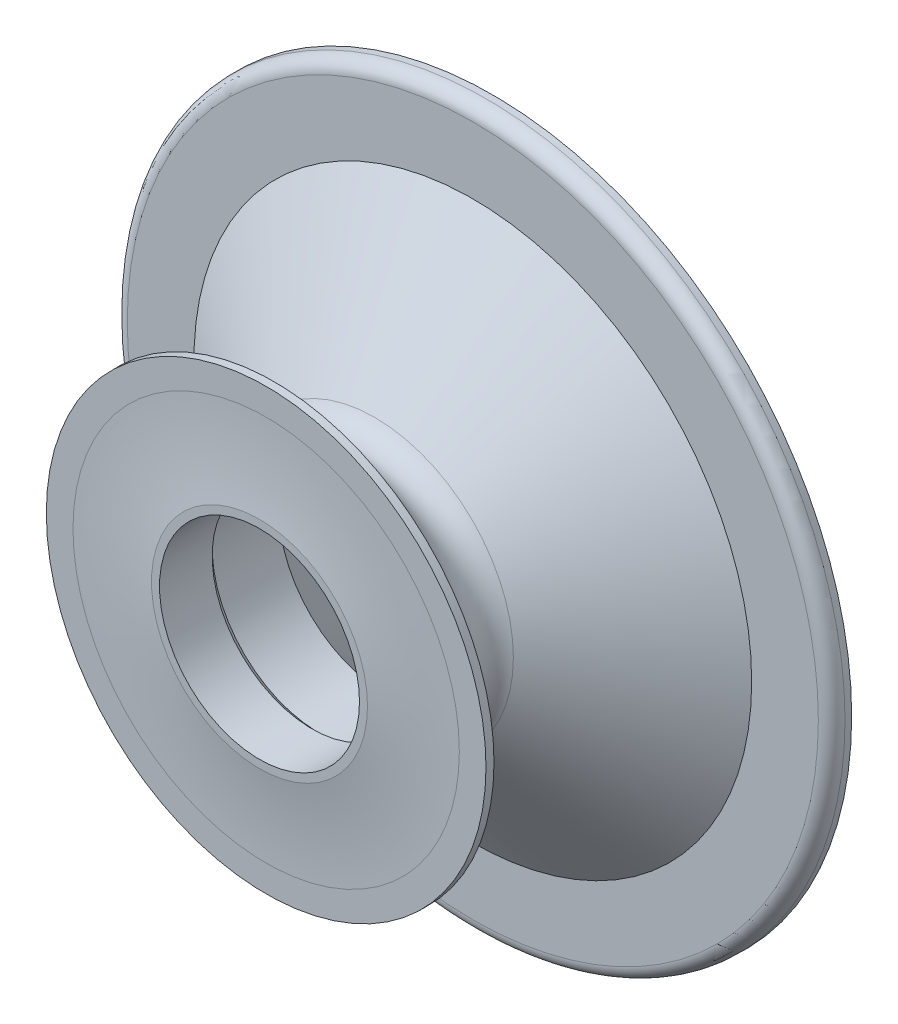
ISO-10303-21;
HEADER;
FILE_DESCRIPTION(('STEP AP214'),'2;1');
FILE_NAME('part.step','',(''),(''),'','','');
FILE_SCHEMA(('AUTOMOTIVE_DESIGN { 1 0 10303 214 1 1 1 1 }'));
ENDSEC;
DATA;
#1=APPLICATION_CONTEXT('core data for automotive mechanical design processes');
#2=APPLICATION_PROTOCOL_DEFINITION('international standard','automotive_design',2000,#1);
#3=PRODUCT_CONTEXT('',#1,'mechanical');
#4=PRODUCT('Part','Part','',(#3));
#5=PRODUCT_RELATED_PRODUCT_CATEGORY('part','',(#4));
#6=PRODUCT_DEFINITION_FORMATION('','',#4);
#7=PRODUCT_DEFINITION_CONTEXT('part definition',#1,'design');
#8=PRODUCT_DEFINITION('design','',#6,#7);
#9=PRODUCT_DEFINITION_SHAPE('','',#8);
#10=(LENGTH_UNIT() NAMED_UNIT(*) SI_UNIT(.MILLI.,.METRE.));
#11=(NAMED_UNIT(*) PLANE_ANGLE_UNIT() SI_UNIT($,.RADIAN.));
#12=(NAMED_UNIT(*) SI_UNIT($,.STERADIAN.) SOLID_ANGLE_UNIT());
#13=UNCERTAINTY_MEASURE_WITH_UNIT(LENGTH_MEASURE(1.E-05),#10,'distance_accuracy_value','');
#14=(GEOMETRIC_REPRESENTATION_CONTEXT(3) GLOBAL_UNCERTAINTY_ASSIGNED_CONTEXT((#13)) GLOBAL_UNIT_ASSIGNED_CONTEXT((#10,
#11,#12)) REPRESENTATION_CONTEXT('',''));
#15=CARTESIAN_POINT('',(0.,0.,0.));
#16=DIRECTION('',(0.,0.,1.));
#17=DIRECTION('',(1.,0.,0.));
#18=AXIS2_PLACEMENT_3D('',#15,#16,#17);
#19=CARTESIAN_POINT('',(0.,0.,3.05));
#20=DIRECTION('',(0.,0.,-1.));
#21=DIRECTION('',(-1.,0.,0.));
#22=AXIS2_PLACEMENT_3D('',#19,#20,#21);
#23=CONICAL_SURFACE('',#22,7.5,0.785398163397453);
#24=CARTESIAN_POINT('',(0.,0.,2.5));
#25=DIRECTION('',(0.,0.,1.));
#26=DIRECTION('',(1.,0.,0.));
#27=AXIS2_PLACEMENT_3D('',#24,#25,#26);
#28=CIRCLE('',#27,8.05);
#29=CARTESIAN_POINT('',(8.05,0.,2.5));
#30=VERTEX_POINT('',#29);
#31=EDGE_CURVE('E81',#30,#30,#28,.T.);
#32=ORIENTED_EDGE('',*,*,#31,.F.);
#33=EDGE_LOOP('',(#32));
#34=FACE_BOUND('',#33,.T.);
#35=CARTESIAN_POINT('',(0.,0.,3.05));
#36=DIRECTION('',(0.,0.,1.));
#37=DIRECTION('',(1.,0.,0.));
#38=AXIS2_PLACEMENT_3D('',#35,#36,#37);
#39=CIRCLE('',#38,7.5);
#40=CARTESIAN_POINT('',(7.5,0.,3.05));
#41=VERTEX_POINT('',#40);
#42=EDGE_CURVE('E42',#41,#41,#39,.T.);
#43=ORIENTED_EDGE('',*,*,#42,.T.);
#44=EDGE_LOOP('',(#43));
#45=FACE_BOUND('',#44,.T.);
#46=ADVANCED_FACE('F31',(#34,#45),#23,.F.);
#47=CARTESIAN_POINT('',(0.,0.,162.721569490734));
#48=DIRECTION('',(0.,0.,1.));
#49=DIRECTION('',(1.,0.,0.));
#50=AXIS2_PLACEMENT_3D('',#47,#48,#49);
#51=CYLINDRICAL_SURFACE('',#50,7.5);
#52=ORIENTED_EDGE('',*,*,#42,.F.);
#53=EDGE_LOOP('',(#52));
#54=FACE_BOUND('',#53,.T.);
#55=CARTESIAN_POINT('',(0.,0.,7.00000000000001));
#56=DIRECTION('',(0.,0.,1.));
#57=DIRECTION('',(1.,0.,0.));
#58=AXIS2_PLACEMENT_3D('',#55,#56,#57);
#59=CIRCLE('',#58,7.5);
#60=CARTESIAN_POINT('',(7.5,0.,7.00000000000001));
#61=VERTEX_POINT('',#60);
#62=EDGE_CURVE('E46',#61,#61,#59,.T.);
#63=ORIENTED_EDGE('',*,*,#62,.T.);
#64=EDGE_LOOP('',(#63));
#65=FACE_BOUND('',#64,.T.);
#66=ADVANCED_FACE('F89',(#54,#65),#51,.F.);
#67=CARTESIAN_POINT('',(0.,7.5,7.));
#68=DIRECTION('',(0.,0.,-1.));
#69=DIRECTION('',(-1.,0.,0.));
#70=AXIS2_PLACEMENT_3D('',#67,#68,#69);
#71=PLANE('',#70);
#72=ORIENTED_EDGE('',*,*,#62,.F.);
#73=EDGE_LOOP('',(#72));
#74=FACE_BOUND('',#73,.T.);
#75=CARTESIAN_POINT('',(0.,0.,7.00000000000001));
#76=DIRECTION('',(0.,0.,1.));
#77=DIRECTION('',(1.,0.,0.));
#78=AXIS2_PLACEMENT_3D('',#75,#76,#77);
#79=CIRCLE('',#78,8.10000000000001);
#80=CARTESIAN_POINT('',(8.10000000000001,0.,7.00000000000001));
#81=VERTEX_POINT('',#80);
#82=EDGE_CURVE('E51',#81,#81,#79,.T.);
#83=ORIENTED_EDGE('',*,*,#82,.T.);
#84=EDGE_LOOP('',(#83));
#85=FACE_BOUND('',#84,.T.);
#86=ADVANCED_FACE('F94',(#74,#85),#71,.F.);
#87=CARTESIAN_POINT('',(0.,0.,47.5716165812711));
#88=DIRECTION('',(0.,0.,1.));
#89=DIRECTION('',(1.,0.,0.));
#90=AXIS2_PLACEMENT_3D('',#87,#88,#89);
#91=DEGENERATE_TOROIDAL_SURFACE('',#90,14.4891796485363,41.0716165812711,.T.);
#92=ORIENTED_EDGE('',*,*,#82,.F.);
#93=EDGE_LOOP('',(#92));
#94=FACE_BOUND('',#93,.T.);
#95=CARTESIAN_POINT('',(0.,0.,6.50000000000001));
#96=DIRECTION('',(0.,0.,1.));
#97=DIRECTION('',(1.,0.,0.));
#98=AXIS2_PLACEMENT_3D('',#95,#96,#97);
#99=CIRCLE('',#98,14.4891796485363);
#100=CARTESIAN_POINT('',(14.4891796485363,0.,6.50000000000001));
#101=VERTEX_POINT('',#100);
#102=EDGE_CURVE('E54',#101,#101,#99,.T.);
#103=ORIENTED_EDGE('',*,*,#102,.T.);
#104=EDGE_LOOP('',(#103));
#105=FACE_BOUND('',#104,.T.);
#106=ADVANCED_FACE('F100',(#94,#105),#91,.F.);
#107=CARTESIAN_POINT('',(0.,16.4891796485363,6.5));
#108=DIRECTION('',(0.,0.,-1.));
#109=DIRECTION('',(-1.,0.,0.));
#110=AXIS2_PLACEMENT_3D('',#107,#108,#109);
#111=PLANE('',#110);
#112=ORIENTED_EDGE('',*,*,#102,.F.);
#113=EDGE_LOOP('',(#112));
#114=FACE_BOUND('',#113,.T.);
#115=CARTESIAN_POINT('',(0.,0.,6.50000000000001));
#116=DIRECTION('',(0.,0.,1.));
#117=DIRECTION('',(1.,0.,0.));
#118=AXIS2_PLACEMENT_3D('',#115,#116,#117);
#119=CIRCLE('',#118,16.4891796485363);
#120=CARTESIAN_POINT('',(16.4891796485363,0.,6.50000000000001));
#121=VERTEX_POINT('',#120);
#122=EDGE_CURVE('E57',#121,#121,#119,.T.);
#123=ORIENTED_EDGE('',*,*,#122,.T.);
#124=EDGE_LOOP('',(#123));
#125=FACE_BOUND('',#124,.T.);
#126=ADVANCED_FACE('F106',(#114,#125),#111,.F.);
#127=CARTESIAN_POINT('',(0.,0.,162.721569490734));
#128=DIRECTION('',(0.,0.,1.));
#129=DIRECTION('',(1.,0.,0.));
#130=AXIS2_PLACEMENT_3D('',#127,#128,#129);
#131=CYLINDRICAL_SURFACE('',#130,16.4891796485363);
#132=ORIENTED_EDGE('',*,*,#122,.F.);
#133=EDGE_LOOP('',(#132));
#134=FACE_BOUND('',#133,.T.);
#135=CARTESIAN_POINT('',(0.,0.,5.90000000000002));
#136=DIRECTION('',(0.,0.,1.));
#137=DIRECTION('',(1.,0.,0.));
#138=AXIS2_PLACEMENT_3D('',#135,#136,#137);
#139=CIRCLE('',#138,16.4891796485363);
#140=CARTESIAN_POINT('',(16.4891796485363,0.,5.90000000000002));
#141=VERTEX_POINT('',#140);
#142=EDGE_CURVE('E60',#141,#141,#139,.T.);
#143=ORIENTED_EDGE('',*,*,#142,.T.);
#144=EDGE_LOOP('',(#143));
#145=FACE_BOUND('',#144,.T.);
#146=ADVANCED_FACE('F112',(#134,#145),#131,.T.);
#147=CARTESIAN_POINT('',(0.,0.,1.63830408857799));
#148=DIRECTION('',(0.,0.,1.));
#149=DIRECTION('',(1.,0.,0.));
#150=AXIS2_PLACEMENT_3D('',#147,#148,#149);
#151=CONICAL_SURFACE('',#150,10.4028471272979,0.959931088596884);
#152=ORIENTED_EDGE('',*,*,#142,.F.);
#153=EDGE_LOOP('',(#152));
#154=FACE_BOUND('',#153,.T.);
#155=CARTESIAN_POINT('',(0.,0.,1.63830408857799));
#156=DIRECTION('',(0.,0.,1.));
#157=DIRECTION('',(1.,0.,0.));
#158=AXIS2_PLACEMENT_3D('',#155,#156,#157);
#159=CIRCLE('',#158,10.4028471272979);
#160=CARTESIAN_POINT('',(10.4028471272979,0.,1.63830408857799));
#161=VERTEX_POINT('',#160);
#162=EDGE_CURVE('E63',#161,#161,#159,.T.);
#163=ORIENTED_EDGE('',*,*,#162,.T.);
#164=EDGE_LOOP('',(#163));
#165=FACE_BOUND('',#164,.T.);
#166=ADVANCED_FACE('F118',(#154,#165),#151,.T.);
#167=CARTESIAN_POINT('',(0.,0.,0.));
#168=DIRECTION('',(0.,0.,1.));
#169=DIRECTION('',(1.,0.,0.));
#170=AXIS2_PLACEMENT_3D('',#167,#168,#169);
#171=TOROIDAL_SURFACE('',#170,11.55,2.);
#172=ORIENTED_EDGE('',*,*,#162,.F.);
#173=EDGE_LOOP('',(#172));
#174=FACE_BOUND('',#173,.T.);
#175=CARTESIAN_POINT('',(0.,0.,-1.63830408857799));
#176=DIRECTION('',(0.,0.,1.));
#177=DIRECTION('',(1.,0.,0.));
#178=AXIS2_PLACEMENT_3D('',#175,#176,#177);
#179=CIRCLE('',#178,10.4028471272979);
#180=CARTESIAN_POINT('',(10.4028471272979,0.,-1.63830408857799));
#181=VERTEX_POINT('',#180);
#182=EDGE_CURVE('E66',#181,#181,#179,.T.);
#183=ORIENTED_EDGE('',*,*,#182,.T.);
#184=EDGE_LOOP('',(#183));
#185=FACE_BOUND('',#184,.T.);
#186=ADVANCED_FACE('F124',(#174,#185),#171,.F.);
#187=CARTESIAN_POINT('',(0.,0.,-9.00000000000001));
#188=DIRECTION('',(0.,0.,-1.));
#189=DIRECTION('',(-1.,0.,0.));
#190=AXIS2_PLACEMENT_3D('',#187,#188,#189);
#191=CONICAL_SURFACE('',#190,20.9164384694369,0.959931088596885);
#192=ORIENTED_EDGE('',*,*,#182,.F.);
#193=EDGE_LOOP('',(#192));
#194=FACE_BOUND('',#193,.T.);
#195=CARTESIAN_POINT('',(0.,0.,-9.00000000000001));
#196=DIRECTION('',(0.,0.,1.));
#197=DIRECTION('',(1.,0.,0.));
#198=AXIS2_PLACEMENT_3D('',#195,#196,#197);
#199=CIRCLE('',#198,20.9164384694369);
#200=CARTESIAN_POINT('',(20.9164384694369,0.,-9.00000000000001));
#201=VERTEX_POINT('',#200);
#202=EDGE_CURVE('E69',#201,#201,#199,.T.);
#203=ORIENTED_EDGE('',*,*,#202,.T.);
#204=EDGE_LOOP('',(#203));
#205=FACE_BOUND('',#204,.T.);
#206=ADVANCED_FACE('F130',(#194,#205),#191,.T.);
#207=CARTESIAN_POINT('',(0.,20.9164384694369,-9.));
#208=DIRECTION('',(0.,0.,-1.));
#209=DIRECTION('',(-1.,0.,0.));
#210=AXIS2_PLACEMENT_3D('',#207,#208,#209);
#211=PLANE('',#210);
#212=CARTESIAN_POINT('',(0.,0.,-9.));
#213=DIRECTION('',(0.,0.,-1.));
#214=DIRECTION('',(-1.,0.,0.));
#215=AXIS2_PLACEMENT_3D('',#212,#213,#214);
#216=CIRCLE('',#215,25.9164384694369);
#217=CARTESIAN_POINT('',(-25.9164384694369,0.,-9.));
#218=VERTEX_POINT('',#217);
#219=EDGE_CURVE('E38',#218,#218,#216,.F.);
#220=ORIENTED_EDGE('',*,*,#219,.T.);
#221=EDGE_LOOP('',(#220));
#222=FACE_BOUND('',#221,.T.);
#223=ORIENTED_EDGE('',*,*,#202,.F.);
#224=EDGE_LOOP('',(#223));
#225=FACE_BOUND('',#224,.T.);
#226=ADVANCED_FACE('F136',(#222,#225),#211,.F.);
#227=CARTESIAN_POINT('',(0.,0.,162.721569490734));
#228=DIRECTION('',(0.,0.,1.));
#229=DIRECTION('',(1.,0.,0.));
#230=AXIS2_PLACEMENT_3D('',#227,#228,#229);
#231=CYLINDRICAL_SURFACE('',#230,26.9164384694369);
#232=CARTESIAN_POINT('',(0.,0.,-10.));
#233=DIRECTION('',(0.,0.,-1.));
#234=DIRECTION('',(-1.,0.,0.));
#235=AXIS2_PLACEMENT_3D('',#232,#233,#234);
#236=CIRCLE('',#235,26.9164384694369);
#237=CARTESIAN_POINT('',(-26.9164384694369,0.,-10.));
#238=VERTEX_POINT('',#237);
#239=EDGE_CURVE('E10',#238,#238,#236,.T.);
#240=ORIENTED_EDGE('',*,*,#239,.T.);
#241=EDGE_LOOP('',(#240));
#242=FACE_BOUND('',#241,.T.);
#243=CARTESIAN_POINT('',(0.,0.,-10.5));
#244=DIRECTION('',(0.,0.,1.));
#245=DIRECTION('',(1.,0.,0.));
#246=AXIS2_PLACEMENT_3D('',#243,#244,#245);
#247=CIRCLE('',#246,26.9164384694369);
#248=CARTESIAN_POINT('',(26.9164384694369,0.,-10.5));
#249=VERTEX_POINT('',#248);
#250=EDGE_CURVE('E72',#249,#249,#247,.T.);
#251=ORIENTED_EDGE('',*,*,#250,.T.);
#252=EDGE_LOOP('',(#251));
#253=FACE_BOUND('',#252,.T.);
#254=ADVANCED_FACE('F141',(#242,#253),#231,.T.);
#255=CARTESIAN_POINT('',(0.,26.9164384694369,-10.5));
#256=DIRECTION('',(0.,0.,1.));
#257=DIRECTION('',(1.,0.,0.));
#258=AXIS2_PLACEMENT_3D('',#255,#256,#257);
#259=PLANE('',#258);
#260=ORIENTED_EDGE('',*,*,#250,.F.);
#261=EDGE_LOOP('',(#260));
#262=FACE_BOUND('',#261,.T.);
#263=CARTESIAN_POINT('',(0.,0.,-10.5));
#264=DIRECTION('',(0.,0.,1.));
#265=DIRECTION('',(1.,0.,0.));
#266=AXIS2_PLACEMENT_3D('',#263,#264,#265);
#267=CIRCLE('',#266,16.05);
#268=CARTESIAN_POINT('',(16.05,0.,-10.5));
#269=VERTEX_POINT('',#268);
#270=EDGE_CURVE('E75',#269,#269,#267,.T.);
#271=ORIENTED_EDGE('',*,*,#270,.T.);
#272=EDGE_LOOP('',(#271));
#273=FACE_BOUND('',#272,.T.);
#274=ADVANCED_FACE('F146',(#262,#273),#259,.F.);
#275=CARTESIAN_POINT('',(0.,0.,-2.5));
#276=DIRECTION('',(0.,0.,-1.));
#277=DIRECTION('',(-1.,0.,0.));
#278=AXIS2_PLACEMENT_3D('',#275,#276,#277);
#279=CONICAL_SURFACE('',#278,8.05,0.785398163397446);
#280=ORIENTED_EDGE('',*,*,#270,.F.);
#281=EDGE_LOOP('',(#280));
#282=FACE_BOUND('',#281,.T.);
#283=CARTESIAN_POINT('',(0.,0.,-2.5));
#284=DIRECTION('',(0.,0.,1.));
#285=DIRECTION('',(1.,0.,0.));
#286=AXIS2_PLACEMENT_3D('',#283,#284,#285);
#287=CIRCLE('',#286,8.05);
#288=CARTESIAN_POINT('',(8.05,0.,-2.5));
#289=VERTEX_POINT('',#288);
#290=EDGE_CURVE('E78',#289,#289,#287,.T.);
#291=ORIENTED_EDGE('',*,*,#290,.T.);
#292=EDGE_LOOP('',(#291));
#293=FACE_BOUND('',#292,.T.);
#294=ADVANCED_FACE('F151',(#282,#293),#279,.F.);
#295=CARTESIAN_POINT('',(0.,0.,162.721569490734));
#296=DIRECTION('',(0.,0.,1.));
#297=DIRECTION('',(1.,0.,0.));
#298=AXIS2_PLACEMENT_3D('',#295,#296,#297);
#299=CYLINDRICAL_SURFACE('',#298,8.05);
#300=ORIENTED_EDGE('',*,*,#290,.F.);
#301=EDGE_LOOP('',(#300));
#302=FACE_BOUND('',#301,.T.);
#303=ORIENTED_EDGE('',*,*,#31,.T.);
#304=EDGE_LOOP('',(#303));
#305=FACE_BOUND('',#304,.T.);
#306=ADVANCED_FACE('F85',(#302,#305),#299,.F.);
#307=CARTESIAN_POINT('',(0.,0.,-10.));
#308=DIRECTION('',(0.,0.,-1.));
#309=DIRECTION('',(-1.,0.,0.));
#310=AXIS2_PLACEMENT_3D('',#307,#308,#309);
#311=TOROIDAL_SURFACE('',#310,25.9164384694369,1.);
#312=ORIENTED_EDGE('',*,*,#239,.F.);
#313=EDGE_LOOP('',(#312));
#314=FACE_BOUND('',#313,.T.);
#315=ORIENTED_EDGE('',*,*,#219,.F.);
#316=EDGE_LOOP('',(#315));
#317=FACE_BOUND('',#316,.T.);
#318=ADVANCED_FACE('F33',(#314,#317),#311,.T.);
#319=CLOSED_SHELL('',(#46,#66,#86,#106,#126,#146,#166,#186,#206,#226,#254,#274,#294,#306,#318));
#320=MANIFOLD_SOLID_BREP('B2',#319);
#321=ADVANCED_BREP_SHAPE_REPRESENTATION('',(#18,#320),#14);
#322=SHAPE_DEFINITION_REPRESENTATION(#9,#321);
ENDSEC;
END-ISO-10303-21;
